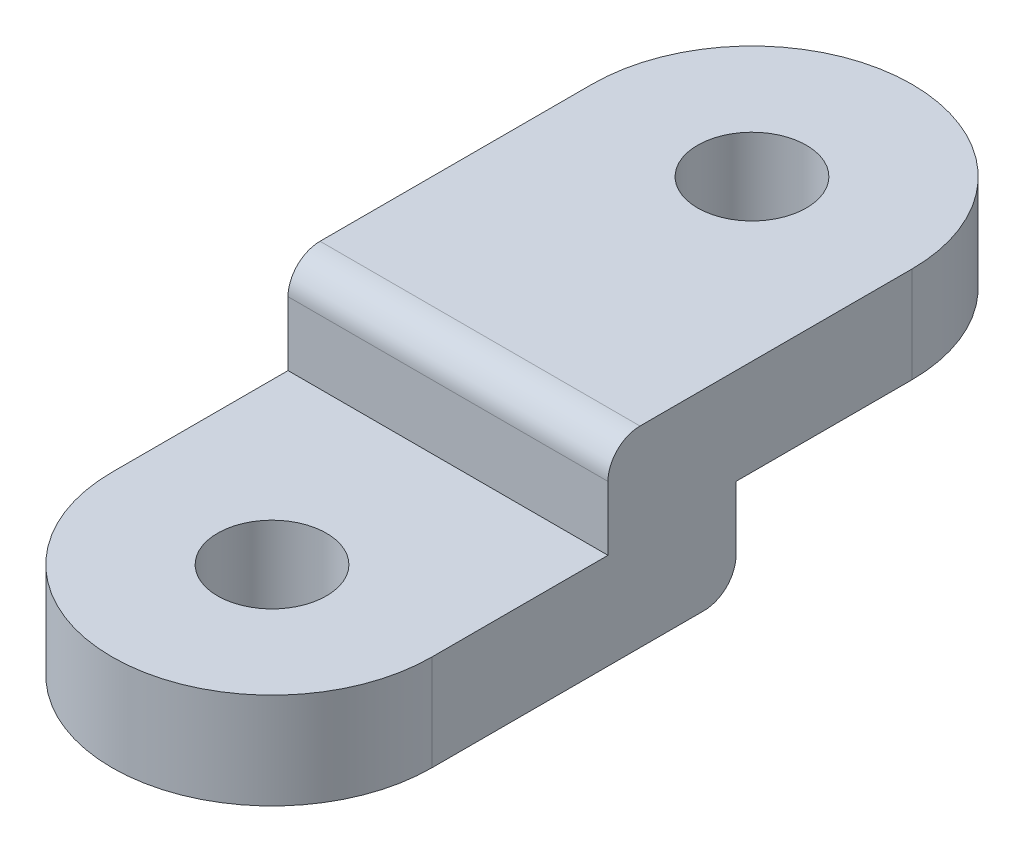
ISO-10303-21;
HEADER;
FILE_DESCRIPTION(('STEP AP214'),'2;1');
FILE_NAME('part.step','',(''),(''),'','','');
FILE_SCHEMA(('AUTOMOTIVE_DESIGN { 1 0 10303 214 1 1 1 1 }'));
ENDSEC;
DATA;
#1=APPLICATION_CONTEXT('core data for automotive mechanical design processes');
#2=APPLICATION_PROTOCOL_DEFINITION('international standard','automotive_design',2000,#1);
#3=PRODUCT_CONTEXT('',#1,'mechanical');
#4=PRODUCT('Part','Part','',(#3));
#5=PRODUCT_RELATED_PRODUCT_CATEGORY('part','',(#4));
#6=PRODUCT_DEFINITION_FORMATION('','',#4);
#7=PRODUCT_DEFINITION_CONTEXT('part definition',#1,'design');
#8=PRODUCT_DEFINITION('design','',#6,#7);
#9=PRODUCT_DEFINITION_SHAPE('','',#8);
#10=(LENGTH_UNIT() NAMED_UNIT(*) SI_UNIT(.MILLI.,.METRE.));
#11=(NAMED_UNIT(*) PLANE_ANGLE_UNIT() SI_UNIT($,.RADIAN.));
#12=(NAMED_UNIT(*) SI_UNIT($,.STERADIAN.) SOLID_ANGLE_UNIT());
#13=UNCERTAINTY_MEASURE_WITH_UNIT(LENGTH_MEASURE(1.E-05),#10,'distance_accuracy_value','');
#14=(GEOMETRIC_REPRESENTATION_CONTEXT(3) GLOBAL_UNCERTAINTY_ASSIGNED_CONTEXT((#13)) GLOBAL_UNIT_ASSIGNED_CONTEXT((#10,
#11,#12)) REPRESENTATION_CONTEXT('',''));
#15=CARTESIAN_POINT('',(0.,0.,0.));
#16=DIRECTION('',(0.,0.,1.));
#17=DIRECTION('',(1.,0.,0.));
#18=AXIS2_PLACEMENT_3D('',#15,#16,#17);
#19=CARTESIAN_POINT('',(10.,0.,0.));
#20=DIRECTION('',(0.,1.,0.));
#21=DIRECTION('',(0.,0.,1.));
#22=AXIS2_PLACEMENT_3D('',#19,#20,#21);
#23=PLANE('',#22);
#24=CARTESIAN_POINT('',(9.99999999999999,0.,-30.));
#25=DIRECTION('',(0.,1.,0.));
#26=DIRECTION('',(0.,0.,1.));
#27=AXIS2_PLACEMENT_3D('',#24,#25,#26);
#28=CIRCLE('',#27,3.39999999999999);
#29=CARTESIAN_POINT('',(9.99999999999999,0.,-26.6));
#30=VERTEX_POINT('',#29);
#31=EDGE_CURVE('E153',#30,#30,#28,.T.);
#32=ORIENTED_EDGE('',*,*,#31,.T.);
#33=EDGE_LOOP('',(#32));
#34=FACE_BOUND('',#33,.T.);
#35=CARTESIAN_POINT('',(9.99999999999999,0.,-30.));
#36=DIRECTION('',(0.,1.,0.));
#37=DIRECTION('',(0.,0.,1.));
#38=AXIS2_PLACEMENT_3D('',#35,#36,#37);
#39=CIRCLE('',#38,10.);
#40=CARTESIAN_POINT('',(20.,0.,-30.));
#41=VERTEX_POINT('',#40);
#42=CARTESIAN_POINT('',(0.,0.,-30.));
#43=VERTEX_POINT('',#42);
#44=EDGE_CURVE('E175',#41,#43,#39,.T.);
#45=ORIENTED_EDGE('',*,*,#44,.F.);
#46=DIRECTION('',(0.,0.,1.));
#47=VECTOR('',#46,1.);
#48=CARTESIAN_POINT('',(20.,0.,-30.));
#49=LINE('',#48,#47);
#50=CARTESIAN_POINT('',(20.,0.,-19.));
#51=VERTEX_POINT('',#50);
#52=EDGE_CURVE('E130',#41,#51,#49,.T.);
#53=ORIENTED_EDGE('',*,*,#52,.T.);
#54=DIRECTION('',(1.,0.,0.));
#55=VECTOR('',#54,1.);
#56=CARTESIAN_POINT('',(0.,0.,-19.));
#57=LINE('',#56,#55);
#58=CARTESIAN_POINT('',(0.,0.,-19.));
#59=VERTEX_POINT('',#58);
#60=EDGE_CURVE('E124',#59,#51,#57,.T.);
#61=ORIENTED_EDGE('',*,*,#60,.F.);
#62=DIRECTION('',(0.,0.,1.));
#63=VECTOR('',#62,1.);
#64=CARTESIAN_POINT('',(0.,0.,-30.));
#65=LINE('',#64,#63);
#66=EDGE_CURVE('E128',#43,#59,#65,.T.);
#67=ORIENTED_EDGE('',*,*,#66,.F.);
#68=EDGE_LOOP('',(#45,#53,#61,#67));
#69=FACE_BOUND('',#68,.T.);
#70=ADVANCED_FACE('F47',(#34,#69),#23,.F.);
#71=CARTESIAN_POINT('',(10.,6.,0.));
#72=DIRECTION('',(0.,-1.,0.));
#73=DIRECTION('',(0.,0.,-1.));
#74=AXIS2_PLACEMENT_3D('',#71,#72,#73);
#75=CYLINDRICAL_SURFACE('',#74,10.);
#76=CARTESIAN_POINT('',(10.,-6.,0.));
#77=DIRECTION('',(0.,1.,0.));
#78=DIRECTION('',(0.,0.,1.));
#79=AXIS2_PLACEMENT_3D('',#76,#77,#78);
#80=CIRCLE('',#79,10.);
#81=CARTESIAN_POINT('',(0.,-6.,0.));
#82=VERTEX_POINT('',#81);
#83=CARTESIAN_POINT('',(20.,-6.,0.));
#84=VERTEX_POINT('',#83);
#85=EDGE_CURVE('E172',#82,#84,#80,.T.);
#86=ORIENTED_EDGE('',*,*,#85,.T.);
#87=DIRECTION('',(0.,-1.,0.));
#88=VECTOR('',#87,1.);
#89=CARTESIAN_POINT('',(20.,6.,0.));
#90=LINE('',#89,#88);
#91=CARTESIAN_POINT('',(20.,0.,0.));
#92=VERTEX_POINT('',#91);
#93=EDGE_CURVE('E190',#92,#84,#90,.T.);
#94=ORIENTED_EDGE('',*,*,#93,.F.);
#95=CARTESIAN_POINT('',(10.,0.,0.));
#96=DIRECTION('',(0.,-1.,0.));
#97=DIRECTION('',(0.,0.,-1.));
#98=AXIS2_PLACEMENT_3D('',#95,#96,#97);
#99=CIRCLE('',#98,10.);
#100=CARTESIAN_POINT('',(0.,0.,0.));
#101=VERTEX_POINT('',#100);
#102=EDGE_CURVE('E170',#92,#101,#99,.T.);
#103=ORIENTED_EDGE('',*,*,#102,.T.);
#104=DIRECTION('',(0.,-1.,0.));
#105=VECTOR('',#104,1.);
#106=CARTESIAN_POINT('',(0.,6.,0.));
#107=LINE('',#106,#105);
#108=EDGE_CURVE('E182',#101,#82,#107,.T.);
#109=ORIENTED_EDGE('',*,*,#108,.T.);
#110=EDGE_LOOP('',(#86,#94,#103,#109));
#111=FACE_BOUND('',#110,.T.);
#112=ADVANCED_FACE('F224',(#111),#75,.T.);
#113=CARTESIAN_POINT('',(20.,6.,-30.));
#114=DIRECTION('',(-1.,0.,0.));
#115=DIRECTION('',(0.,0.,1.));
#116=AXIS2_PLACEMENT_3D('',#113,#114,#115);
#117=PLANE('',#116);
#118=DIRECTION('',(0.,0.,1.));
#119=VECTOR('',#118,1.);
#120=CARTESIAN_POINT('',(20.,-6.,-19.));
#121=LINE('',#120,#119);
#122=CARTESIAN_POINT('',(20.,-6.,-17.));
#123=VERTEX_POINT('',#122);
#124=EDGE_CURVE('E148',#123,#84,#121,.T.);
#125=ORIENTED_EDGE('',*,*,#124,.F.);
#126=CARTESIAN_POINT('',(20.,-4.,-17.));
#127=DIRECTION('',(-1.,0.,0.));
#128=DIRECTION('',(0.,0.,1.));
#129=AXIS2_PLACEMENT_3D('',#126,#127,#128);
#130=CIRCLE('',#129,2.);
#131=CARTESIAN_POINT('',(20.,-4.,-19.));
#132=VERTEX_POINT('',#131);
#133=EDGE_CURVE('E198',#123,#132,#130,.F.);
#134=ORIENTED_EDGE('',*,*,#133,.T.);
#135=DIRECTION('',(0.,-1.,0.));
#136=VECTOR('',#135,1.);
#137=CARTESIAN_POINT('',(20.,0.,-19.));
#138=LINE('',#137,#136);
#139=EDGE_CURVE('E150',#51,#132,#138,.T.);
#140=ORIENTED_EDGE('',*,*,#139,.F.);
#141=ORIENTED_EDGE('',*,*,#52,.F.);
#142=DIRECTION('',(0.,-1.,0.));
#143=VECTOR('',#142,1.);
#144=CARTESIAN_POINT('',(20.,6.,-30.));
#145=LINE('',#144,#143);
#146=CARTESIAN_POINT('',(20.,6.,-30.));
#147=VERTEX_POINT('',#146);
#148=EDGE_CURVE('E187',#147,#41,#145,.T.);
#149=ORIENTED_EDGE('',*,*,#148,.F.);
#150=DIRECTION('',(0.,0.,-1.));
#151=VECTOR('',#150,1.);
#152=CARTESIAN_POINT('',(20.,6.,-30.));
#153=LINE('',#152,#151);
#154=CARTESIAN_POINT('',(20.,6.,-13.));
#155=VERTEX_POINT('',#154);
#156=EDGE_CURVE('E176',#155,#147,#153,.T.);
#157=ORIENTED_EDGE('',*,*,#156,.F.);
#158=CARTESIAN_POINT('',(20.,4.,-13.));
#159=DIRECTION('',(-1.,0.,0.));
#160=DIRECTION('',(0.,0.,1.));
#161=AXIS2_PLACEMENT_3D('',#158,#159,#160);
#162=CIRCLE('',#161,2.);
#163=CARTESIAN_POINT('',(20.,4.,-11.));
#164=VERTEX_POINT('',#163);
#165=EDGE_CURVE('E196',#155,#164,#162,.F.);
#166=ORIENTED_EDGE('',*,*,#165,.T.);
#167=DIRECTION('',(0.,1.,0.));
#168=VECTOR('',#167,1.);
#169=CARTESIAN_POINT('',(20.,6.,-11.));
#170=LINE('',#169,#168);
#171=CARTESIAN_POINT('',(20.,0.,-11.));
#172=VERTEX_POINT('',#171);
#173=EDGE_CURVE('E163',#172,#164,#170,.T.);
#174=ORIENTED_EDGE('',*,*,#173,.F.);
#175=DIRECTION('',(0.,0.,-1.));
#176=VECTOR('',#175,1.);
#177=CARTESIAN_POINT('',(20.,0.,-11.));
#178=LINE('',#177,#176);
#179=EDGE_CURVE('E134',#92,#172,#178,.T.);
#180=ORIENTED_EDGE('',*,*,#179,.F.);
#181=ORIENTED_EDGE('',*,*,#93,.T.);
#182=EDGE_LOOP('',(#125,#134,#140,#141,#149,#157,#166,#174,#180,#181));
#183=FACE_BOUND('',#182,.T.);
#184=ADVANCED_FACE('F212',(#183),#117,.F.);
#185=CARTESIAN_POINT('',(9.99999999999999,6.,-30.));
#186=DIRECTION('',(0.,-1.,0.));
#187=DIRECTION('',(0.,0.,-1.));
#188=AXIS2_PLACEMENT_3D('',#185,#186,#187);
#189=CYLINDRICAL_SURFACE('',#188,10.);
#190=ORIENTED_EDGE('',*,*,#44,.T.);
#191=DIRECTION('',(0.,-1.,0.));
#192=VECTOR('',#191,1.);
#193=CARTESIAN_POINT('',(0.,6.,-30.));
#194=LINE('',#193,#192);
#195=CARTESIAN_POINT('',(0.,6.,-30.));
#196=VERTEX_POINT('',#195);
#197=EDGE_CURVE('E147',#196,#43,#194,.T.);
#198=ORIENTED_EDGE('',*,*,#197,.F.);
#199=CARTESIAN_POINT('',(9.99999999999999,6.,-30.));
#200=DIRECTION('',(0.,1.,0.));
#201=DIRECTION('',(0.,0.,1.));
#202=AXIS2_PLACEMENT_3D('',#199,#200,#201);
#203=CIRCLE('',#202,10.);
#204=EDGE_CURVE('E178',#147,#196,#203,.T.);
#205=ORIENTED_EDGE('',*,*,#204,.F.);
#206=ORIENTED_EDGE('',*,*,#148,.T.);
#207=EDGE_LOOP('',(#190,#198,#205,#206));
#208=FACE_BOUND('',#207,.T.);
#209=ADVANCED_FACE('F216',(#208),#189,.T.);
#210=CARTESIAN_POINT('',(0.,6.,0.));
#211=DIRECTION('',(1.,0.,0.));
#212=DIRECTION('',(0.,0.,-1.));
#213=AXIS2_PLACEMENT_3D('',#210,#211,#212);
#214=PLANE('',#213);
#215=DIRECTION('',(0.,-1.,0.));
#216=VECTOR('',#215,1.);
#217=CARTESIAN_POINT('',(0.,0.,-19.));
#218=LINE('',#217,#216);
#219=CARTESIAN_POINT('',(0.,-4.,-19.));
#220=VERTEX_POINT('',#219);
#221=EDGE_CURVE('E138',#59,#220,#218,.T.);
#222=ORIENTED_EDGE('',*,*,#221,.T.);
#223=CARTESIAN_POINT('',(0.,-4.,-17.));
#224=DIRECTION('',(1.,0.,0.));
#225=DIRECTION('',(0.,0.,-1.));
#226=AXIS2_PLACEMENT_3D('',#223,#224,#225);
#227=CIRCLE('',#226,2.);
#228=CARTESIAN_POINT('',(0.,-6.,-17.));
#229=VERTEX_POINT('',#228);
#230=EDGE_CURVE('E202',#220,#229,#227,.F.);
#231=ORIENTED_EDGE('',*,*,#230,.T.);
#232=DIRECTION('',(0.,0.,1.));
#233=VECTOR('',#232,1.);
#234=CARTESIAN_POINT('',(0.,-6.,-19.));
#235=LINE('',#234,#233);
#236=EDGE_CURVE('E135',#229,#82,#235,.T.);
#237=ORIENTED_EDGE('',*,*,#236,.T.);
#238=ORIENTED_EDGE('',*,*,#108,.F.);
#239=DIRECTION('',(0.,0.,-1.));
#240=VECTOR('',#239,1.);
#241=CARTESIAN_POINT('',(0.,0.,-11.));
#242=LINE('',#241,#240);
#243=CARTESIAN_POINT('',(0.,0.,-11.));
#244=VERTEX_POINT('',#243);
#245=EDGE_CURVE('E159',#101,#244,#242,.T.);
#246=ORIENTED_EDGE('',*,*,#245,.T.);
#247=DIRECTION('',(0.,1.,0.));
#248=VECTOR('',#247,1.);
#249=CARTESIAN_POINT('',(0.,6.,-11.));
#250=LINE('',#249,#248);
#251=CARTESIAN_POINT('',(0.,4.,-11.));
#252=VERTEX_POINT('',#251);
#253=EDGE_CURVE('E162',#244,#252,#250,.T.);
#254=ORIENTED_EDGE('',*,*,#253,.T.);
#255=CARTESIAN_POINT('',(0.,4.,-13.));
#256=DIRECTION('',(1.,0.,0.));
#257=DIRECTION('',(0.,0.,-1.));
#258=AXIS2_PLACEMENT_3D('',#255,#256,#257);
#259=CIRCLE('',#258,2.);
#260=CARTESIAN_POINT('',(0.,6.,-13.));
#261=VERTEX_POINT('',#260);
#262=EDGE_CURVE('E62',#252,#261,#259,.F.);
#263=ORIENTED_EDGE('',*,*,#262,.T.);
#264=DIRECTION('',(0.,0.,1.));
#265=VECTOR('',#264,1.);
#266=CARTESIAN_POINT('',(0.,6.,0.));
#267=LINE('',#266,#265);
#268=EDGE_CURVE('E180',#196,#261,#267,.T.);
#269=ORIENTED_EDGE('',*,*,#268,.F.);
#270=ORIENTED_EDGE('',*,*,#197,.T.);
#271=ORIENTED_EDGE('',*,*,#66,.T.);
#272=EDGE_LOOP('',(#222,#231,#237,#238,#246,#254,#263,#269,#270,#271));
#273=FACE_BOUND('',#272,.T.);
#274=ADVANCED_FACE('F145',(#273),#214,.F.);
#275=CARTESIAN_POINT('',(10.,6.,0.));
#276=DIRECTION('',(0.,1.,0.));
#277=DIRECTION('',(0.,0.,1.));
#278=AXIS2_PLACEMENT_3D('',#275,#276,#277);
#279=PLANE('',#278);
#280=CARTESIAN_POINT('',(9.99999999999999,6.,-30.));
#281=DIRECTION('',(0.,1.,0.));
#282=DIRECTION('',(0.,0.,1.));
#283=AXIS2_PLACEMENT_3D('',#280,#281,#282);
#284=CIRCLE('',#283,3.39999999999999);
#285=CARTESIAN_POINT('',(9.99999999999999,6.,-26.6));
#286=VERTEX_POINT('',#285);
#287=EDGE_CURVE('E272',#286,#286,#284,.T.);
#288=ORIENTED_EDGE('',*,*,#287,.F.);
#289=EDGE_LOOP('',(#288));
#290=FACE_BOUND('',#289,.T.);
#291=ORIENTED_EDGE('',*,*,#268,.T.);
#292=DIRECTION('',(1.,0.,0.));
#293=VECTOR('',#292,1.);
#294=CARTESIAN_POINT('',(20.,6.,-13.));
#295=LINE('',#294,#293);
#296=EDGE_CURVE('E55',#261,#155,#295,.T.);
#297=ORIENTED_EDGE('',*,*,#296,.T.);
#298=ORIENTED_EDGE('',*,*,#156,.T.);
#299=ORIENTED_EDGE('',*,*,#204,.T.);
#300=EDGE_LOOP('',(#291,#297,#298,#299));
#301=FACE_BOUND('',#300,.T.);
#302=ADVANCED_FACE('F207',(#290,#301),#279,.T.);
#303=CARTESIAN_POINT('',(0.,-6.,-19.));
#304=DIRECTION('',(0.,1.,0.));
#305=DIRECTION('',(0.,0.,1.));
#306=AXIS2_PLACEMENT_3D('',#303,#304,#305);
#307=PLANE('',#306);
#308=CARTESIAN_POINT('',(10.,-6.,0.));
#309=DIRECTION('',(0.,1.,0.));
#310=DIRECTION('',(0.,0.,1.));
#311=AXIS2_PLACEMENT_3D('',#308,#309,#310);
#312=CIRCLE('',#311,3.4);
#313=CARTESIAN_POINT('',(10.,-6.,3.4));
#314=VERTEX_POINT('',#313);
#315=EDGE_CURVE('E267',#314,#314,#312,.T.);
#316=ORIENTED_EDGE('',*,*,#315,.T.);
#317=EDGE_LOOP('',(#316));
#318=FACE_BOUND('',#317,.T.);
#319=ORIENTED_EDGE('',*,*,#236,.F.);
#320=DIRECTION('',(1.,0.,0.));
#321=VECTOR('',#320,1.);
#322=CARTESIAN_POINT('',(0.,-6.,-17.));
#323=LINE('',#322,#321);
#324=EDGE_CURVE('E193',#229,#123,#323,.T.);
#325=ORIENTED_EDGE('',*,*,#324,.T.);
#326=ORIENTED_EDGE('',*,*,#124,.T.);
#327=ORIENTED_EDGE('',*,*,#85,.F.);
#328=EDGE_LOOP('',(#319,#325,#326,#327));
#329=FACE_BOUND('',#328,.T.);
#330=ADVANCED_FACE('F238',(#318,#329),#307,.F.);
#331=CARTESIAN_POINT('',(0.,0.,-19.));
#332=DIRECTION('',(0.,0.,1.));
#333=DIRECTION('',(1.,0.,0.));
#334=AXIS2_PLACEMENT_3D('',#331,#332,#333);
#335=PLANE('',#334);
#336=ORIENTED_EDGE('',*,*,#139,.T.);
#337=DIRECTION('',(1.,0.,0.));
#338=VECTOR('',#337,1.);
#339=CARTESIAN_POINT('',(0.,-4.,-19.));
#340=LINE('',#339,#338);
#341=EDGE_CURVE('E141',#132,#220,#340,.F.);
#342=ORIENTED_EDGE('',*,*,#341,.T.);
#343=ORIENTED_EDGE('',*,*,#221,.F.);
#344=ORIENTED_EDGE('',*,*,#60,.T.);
#345=EDGE_LOOP('',(#336,#342,#343,#344));
#346=FACE_BOUND('',#345,.T.);
#347=ADVANCED_FACE('F139',(#346),#335,.F.);
#348=CARTESIAN_POINT('',(0.,0.,-11.));
#349=DIRECTION('',(0.,-1.,0.));
#350=DIRECTION('',(0.,0.,-1.));
#351=AXIS2_PLACEMENT_3D('',#348,#349,#350);
#352=PLANE('',#351);
#353=CARTESIAN_POINT('',(10.,0.,0.));
#354=DIRECTION('',(0.,1.,0.));
#355=DIRECTION('',(0.,0.,1.));
#356=AXIS2_PLACEMENT_3D('',#353,#354,#355);
#357=CIRCLE('',#356,3.4);
#358=CARTESIAN_POINT('',(10.,0.,3.4));
#359=VERTEX_POINT('',#358);
#360=EDGE_CURVE('E270',#359,#359,#357,.T.);
#361=ORIENTED_EDGE('',*,*,#360,.F.);
#362=EDGE_LOOP('',(#361));
#363=FACE_BOUND('',#362,.T.);
#364=ORIENTED_EDGE('',*,*,#179,.T.);
#365=DIRECTION('',(1.,0.,0.));
#366=VECTOR('',#365,1.);
#367=CARTESIAN_POINT('',(0.,0.,-11.));
#368=LINE('',#367,#366);
#369=EDGE_CURVE('E165',#244,#172,#368,.T.);
#370=ORIENTED_EDGE('',*,*,#369,.F.);
#371=ORIENTED_EDGE('',*,*,#245,.F.);
#372=ORIENTED_EDGE('',*,*,#102,.F.);
#373=EDGE_LOOP('',(#364,#370,#371,#372));
#374=FACE_BOUND('',#373,.T.);
#375=ADVANCED_FACE('F240',(#363,#374),#352,.F.);
#376=CARTESIAN_POINT('',(0.,6.,-11.));
#377=DIRECTION('',(0.,0.,-1.));
#378=DIRECTION('',(-1.,0.,0.));
#379=AXIS2_PLACEMENT_3D('',#376,#377,#378);
#380=PLANE('',#379);
#381=ORIENTED_EDGE('',*,*,#173,.T.);
#382=DIRECTION('',(1.,0.,0.));
#383=VECTOR('',#382,1.);
#384=CARTESIAN_POINT('',(0.,4.,-11.));
#385=LINE('',#384,#383);
#386=EDGE_CURVE('E13',#164,#252,#385,.F.);
#387=ORIENTED_EDGE('',*,*,#386,.T.);
#388=ORIENTED_EDGE('',*,*,#253,.F.);
#389=ORIENTED_EDGE('',*,*,#369,.T.);
#390=EDGE_LOOP('',(#381,#387,#388,#389));
#391=FACE_BOUND('',#390,.T.);
#392=ADVANCED_FACE('F243',(#391),#380,.F.);
#393=CARTESIAN_POINT('',(9.99999999999999,6.,-30.));
#394=DIRECTION('',(0.,1.,0.));
#395=DIRECTION('',(0.,0.,1.));
#396=AXIS2_PLACEMENT_3D('',#393,#394,#395);
#397=CYLINDRICAL_SURFACE('',#396,3.39999999999999);
#398=ORIENTED_EDGE('',*,*,#287,.T.);
#399=EDGE_LOOP('',(#398));
#400=FACE_BOUND('',#399,.T.);
#401=ORIENTED_EDGE('',*,*,#31,.F.);
#402=EDGE_LOOP('',(#401));
#403=FACE_BOUND('',#402,.T.);
#404=ADVANCED_FACE('F247',(#400,#403),#397,.F.);
#405=CARTESIAN_POINT('',(10.,0.,0.));
#406=DIRECTION('',(0.,1.,0.));
#407=DIRECTION('',(0.,0.,1.));
#408=AXIS2_PLACEMENT_3D('',#405,#406,#407);
#409=CYLINDRICAL_SURFACE('',#408,3.4);
#410=ORIENTED_EDGE('',*,*,#315,.F.);
#411=EDGE_LOOP('',(#410));
#412=FACE_BOUND('',#411,.T.);
#413=ORIENTED_EDGE('',*,*,#360,.T.);
#414=EDGE_LOOP('',(#413));
#415=FACE_BOUND('',#414,.T.);
#416=ADVANCED_FACE('F255',(#412,#415),#409,.F.);
#417=CARTESIAN_POINT('',(0.,-4.,-17.));
#418=DIRECTION('',(1.,0.,0.));
#419=DIRECTION('',(0.,0.,-1.));
#420=AXIS2_PLACEMENT_3D('',#417,#418,#419);
#421=CYLINDRICAL_SURFACE('',#420,2.);
#422=ORIENTED_EDGE('',*,*,#230,.F.);
#423=ORIENTED_EDGE('',*,*,#341,.F.);
#424=ORIENTED_EDGE('',*,*,#133,.F.);
#425=ORIENTED_EDGE('',*,*,#324,.F.);
#426=EDGE_LOOP('',(#422,#423,#424,#425));
#427=FACE_BOUND('',#426,.T.);
#428=ADVANCED_FACE('F258',(#427),#421,.T.);
#429=CARTESIAN_POINT('',(9.99999999999999,4.,-13.));
#430=DIRECTION('',(-1.,0.,0.));
#431=DIRECTION('',(0.,0.,1.));
#432=AXIS2_PLACEMENT_3D('',#429,#430,#431);
#433=CYLINDRICAL_SURFACE('',#432,2.);
#434=ORIENTED_EDGE('',*,*,#262,.F.);
#435=ORIENTED_EDGE('',*,*,#386,.F.);
#436=ORIENTED_EDGE('',*,*,#165,.F.);
#437=ORIENTED_EDGE('',*,*,#296,.F.);
#438=EDGE_LOOP('',(#434,#435,#436,#437));
#439=FACE_BOUND('',#438,.T.);
#440=ADVANCED_FACE('F49',(#439),#433,.T.);
#441=CLOSED_SHELL('',(#70,#112,#184,#209,#274,#302,#330,#347,#375,#392,#404,#416,#428,#440));
#442=MANIFOLD_SOLID_BREP('B2',#441);
#443=ADVANCED_BREP_SHAPE_REPRESENTATION('',(#18,#442),#14);
#444=SHAPE_DEFINITION_REPRESENTATION(#9,#443);
ENDSEC;
END-ISO-10303-21;
